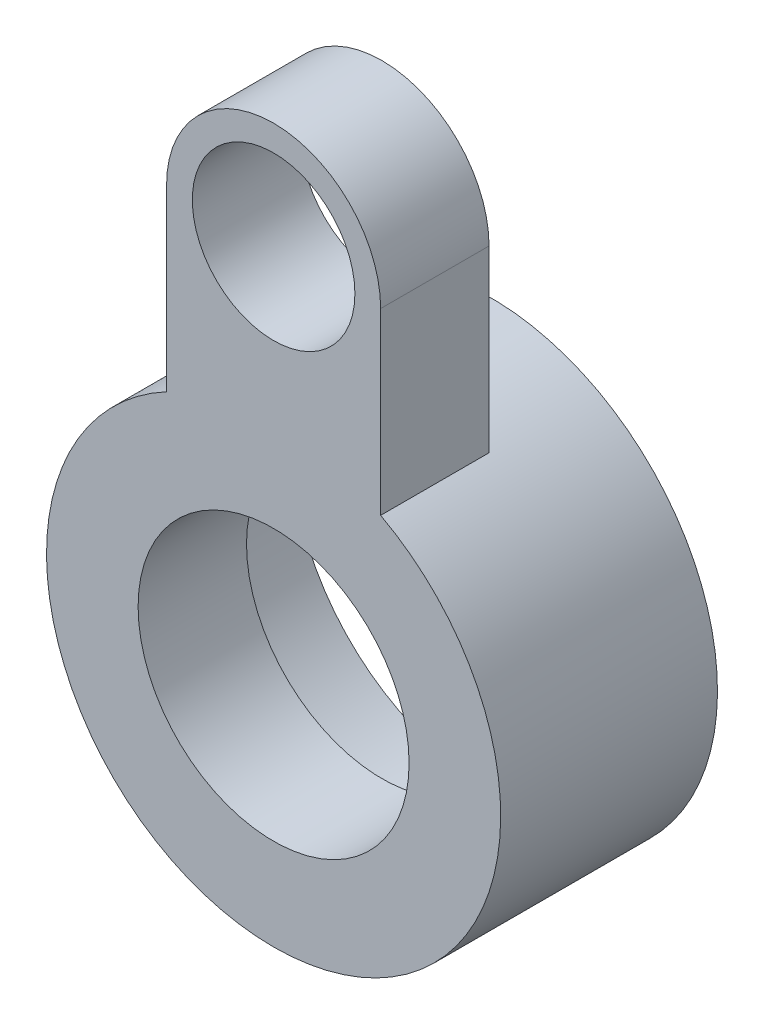
ISO-10303-21;
HEADER;
FILE_DESCRIPTION(('STEP AP214'),'2;1');
FILE_NAME('part.step','',(''),(''),'','','');
FILE_SCHEMA(('AUTOMOTIVE_DESIGN { 1 0 10303 214 1 1 1 1 }'));
ENDSEC;
DATA;
#1=APPLICATION_CONTEXT('core data for automotive mechanical design processes');
#2=APPLICATION_PROTOCOL_DEFINITION('international standard','automotive_design',2000,#1);
#3=PRODUCT_CONTEXT('',#1,'mechanical');
#4=PRODUCT('Part','Part','',(#3));
#5=PRODUCT_RELATED_PRODUCT_CATEGORY('part','',(#4));
#6=PRODUCT_DEFINITION_FORMATION('','',#4);
#7=PRODUCT_DEFINITION_CONTEXT('part definition',#1,'design');
#8=PRODUCT_DEFINITION('design','',#6,#7);
#9=PRODUCT_DEFINITION_SHAPE('','',#8);
#10=(LENGTH_UNIT() NAMED_UNIT(*) SI_UNIT(.MILLI.,.METRE.));
#11=(NAMED_UNIT(*) PLANE_ANGLE_UNIT() SI_UNIT($,.RADIAN.));
#12=(NAMED_UNIT(*) SI_UNIT($,.STERADIAN.) SOLID_ANGLE_UNIT());
#13=UNCERTAINTY_MEASURE_WITH_UNIT(LENGTH_MEASURE(1.E-05),#10,'distance_accuracy_value','');
#14=(GEOMETRIC_REPRESENTATION_CONTEXT(3) GLOBAL_UNCERTAINTY_ASSIGNED_CONTEXT((#13)) GLOBAL_UNIT_ASSIGNED_CONTEXT((#10,
#11,#12)) REPRESENTATION_CONTEXT('',''));
#15=CARTESIAN_POINT('',(0.,0.,0.));
#16=DIRECTION('',(0.,0.,1.));
#17=DIRECTION('',(1.,0.,0.));
#18=AXIS2_PLACEMENT_3D('',#15,#16,#17);
#19=CARTESIAN_POINT('',(0.,0.,0.));
#20=DIRECTION('',(0.,0.,1.));
#21=DIRECTION('',(1.,0.,0.));
#22=AXIS2_PLACEMENT_3D('',#19,#20,#21);
#23=PLANE('',#22);
#24=CARTESIAN_POINT('',(0.,0.,0.));
#25=DIRECTION('',(0.,0.,1.));
#26=DIRECTION('',(1.,0.,0.));
#27=AXIS2_PLACEMENT_3D('',#24,#25,#26);
#28=CIRCLE('',#27,2.5);
#29=CARTESIAN_POINT('',(2.5,0.,0.));
#30=VERTEX_POINT('',#29);
#31=EDGE_CURVE('E114',#30,#30,#28,.T.);
#32=ORIENTED_EDGE('',*,*,#31,.T.);
#33=EDGE_LOOP('',(#32));
#34=FACE_BOUND('',#33,.T.);
#35=CARTESIAN_POINT('',(0.,0.,0.));
#36=DIRECTION('',(0.,0.,-1.));
#37=DIRECTION('',(-1.,0.,0.));
#38=AXIS2_PLACEMENT_3D('',#35,#36,#37);
#39=CIRCLE('',#38,3.66714952792172);
#40=CARTESIAN_POINT('',(-3.66714952792172,0.,0.));
#41=VERTEX_POINT('',#40);
#42=EDGE_CURVE('E162',#41,#41,#39,.T.);
#43=ORIENTED_EDGE('',*,*,#42,.T.);
#44=EDGE_LOOP('',(#43));
#45=FACE_BOUND('',#44,.T.);
#46=ADVANCED_FACE('F52',(#34,#45),#23,.F.);
#47=CARTESIAN_POINT('',(0.,0.,2.));
#48=DIRECTION('',(0.,0.,1.));
#49=DIRECTION('',(1.,0.,0.));
#50=AXIS2_PLACEMENT_3D('',#47,#48,#49);
#51=PLANE('',#50);
#52=CARTESIAN_POINT('',(0.,0.,2.));
#53=DIRECTION('',(0.,0.,1.));
#54=DIRECTION('',(1.,0.,0.));
#55=AXIS2_PLACEMENT_3D('',#52,#53,#54);
#56=CIRCLE('',#55,2.5);
#57=CARTESIAN_POINT('',(2.5,0.,2.));
#58=VERTEX_POINT('',#57);
#59=EDGE_CURVE('E120',#58,#58,#56,.T.);
#60=ORIENTED_EDGE('',*,*,#59,.F.);
#61=EDGE_LOOP('',(#60));
#62=FACE_BOUND('',#61,.T.);
#63=CARTESIAN_POINT('',(0.,7.,2.));
#64=DIRECTION('',(0.,0.,1.));
#65=DIRECTION('',(1.,0.,0.));
#66=AXIS2_PLACEMENT_3D('',#63,#64,#65);
#67=CIRCLE('',#66,1.5);
#68=CARTESIAN_POINT('',(1.5,7.,2.));
#69=VERTEX_POINT('',#68);
#70=EDGE_CURVE('E136',#69,#69,#67,.T.);
#71=ORIENTED_EDGE('',*,*,#70,.F.);
#72=EDGE_LOOP('',(#71));
#73=FACE_BOUND('',#72,.T.);
#74=DIRECTION('',(0.,-1.,0.));
#75=VECTOR('',#74,1.);
#76=CARTESIAN_POINT('',(-1.975,7.,2.));
#77=LINE('',#76,#75);
#78=CARTESIAN_POINT('',(-1.975,7.,2.));
#79=VERTEX_POINT('',#78);
#80=CARTESIAN_POINT('',(-1.975,3.69533151422169,2.));
#81=VERTEX_POINT('',#80);
#82=EDGE_CURVE('E156',#79,#81,#77,.T.);
#83=ORIENTED_EDGE('',*,*,#82,.T.);
#84=CARTESIAN_POINT('',(0.,0.,2.));
#85=DIRECTION('',(0.,0.,1.));
#86=DIRECTION('',(1.,0.,0.));
#87=AXIS2_PLACEMENT_3D('',#84,#85,#86);
#88=CIRCLE('',#87,4.19);
#89=CARTESIAN_POINT('',(1.975,3.6953315142217,2.));
#90=VERTEX_POINT('',#89);
#91=EDGE_CURVE('E111',#81,#90,#88,.T.);
#92=ORIENTED_EDGE('',*,*,#91,.T.);
#93=DIRECTION('',(0.,1.,0.));
#94=VECTOR('',#93,1.);
#95=CARTESIAN_POINT('',(1.97499999999999,7.,2.));
#96=LINE('',#95,#94);
#97=CARTESIAN_POINT('',(1.97499999999999,7.,2.));
#98=VERTEX_POINT('',#97);
#99=EDGE_CURVE('E150',#90,#98,#96,.T.);
#100=ORIENTED_EDGE('',*,*,#99,.T.);
#101=CARTESIAN_POINT('',(0.,7.,2.));
#102=DIRECTION('',(0.,0.,1.));
#103=DIRECTION('',(1.,0.,0.));
#104=AXIS2_PLACEMENT_3D('',#101,#102,#103);
#105=CIRCLE('',#104,1.975);
#106=EDGE_CURVE('E68',#98,#79,#105,.T.);
#107=ORIENTED_EDGE('',*,*,#106,.T.);
#108=EDGE_LOOP('',(#83,#92,#100,#107));
#109=FACE_BOUND('',#108,.T.);
#110=ADVANCED_FACE('F152',(#62,#73,#109),#51,.T.);
#111=CARTESIAN_POINT('',(0.,0.,0.));
#112=DIRECTION('',(0.,0.,-1.));
#113=DIRECTION('',(-1.,0.,0.));
#114=AXIS2_PLACEMENT_3D('',#111,#112,#113);
#115=CIRCLE('',#114,4.19);
#116=CARTESIAN_POINT('',(-1.975,3.69533151422169,0.));
#117=VERTEX_POINT('',#116);
#118=CARTESIAN_POINT('',(1.975,3.6953315142217,0.));
#119=VERTEX_POINT('',#118);
#120=EDGE_CURVE('E76',#117,#119,#115,.T.);
#121=ORIENTED_EDGE('',*,*,#120,.F.);
#122=DIRECTION('',(0.,-1.,0.));
#123=VECTOR('',#122,1.);
#124=CARTESIAN_POINT('',(-1.975,0.,0.));
#125=LINE('',#124,#123);
#126=CARTESIAN_POINT('',(-1.975,7.,0.));
#127=VERTEX_POINT('',#126);
#128=EDGE_CURVE('E13',#127,#117,#125,.T.);
#129=ORIENTED_EDGE('',*,*,#128,.F.);
#130=CARTESIAN_POINT('',(0.,7.,0.));
#131=DIRECTION('',(0.,0.,1.));
#132=DIRECTION('',(1.,0.,0.));
#133=AXIS2_PLACEMENT_3D('',#130,#131,#132);
#134=CIRCLE('',#133,1.975);
#135=CARTESIAN_POINT('',(1.975,7.,0.));
#136=VERTEX_POINT('',#135);
#137=EDGE_CURVE('E61',#136,#127,#134,.T.);
#138=ORIENTED_EDGE('',*,*,#137,.F.);
#139=DIRECTION('',(0.,1.,0.));
#140=VECTOR('',#139,1.);
#141=CARTESIAN_POINT('',(1.975,0.,0.));
#142=LINE('',#141,#140);
#143=EDGE_CURVE('E97',#119,#136,#142,.T.);
#144=ORIENTED_EDGE('',*,*,#143,.F.);
#145=EDGE_LOOP('',(#121,#129,#138,#144));
#146=FACE_BOUND('',#145,.T.);
#147=CARTESIAN_POINT('',(0.,7.,0.));
#148=DIRECTION('',(0.,0.,1.));
#149=DIRECTION('',(1.,0.,0.));
#150=AXIS2_PLACEMENT_3D('',#147,#148,#149);
#151=CIRCLE('',#150,1.5);
#152=CARTESIAN_POINT('',(1.5,7.,0.));
#153=VERTEX_POINT('',#152);
#154=EDGE_CURVE('E134',#153,#153,#151,.T.);
#155=ORIENTED_EDGE('',*,*,#154,.T.);
#156=EDGE_LOOP('',(#155));
#157=FACE_BOUND('',#156,.T.);
#158=ADVANCED_FACE('F54',(#146,#157),#23,.F.);
#159=CARTESIAN_POINT('',(0.,7.,2.));
#160=DIRECTION('',(0.,0.,-1.));
#161=DIRECTION('',(-1.,0.,0.));
#162=AXIS2_PLACEMENT_3D('',#159,#160,#161);
#163=CYLINDRICAL_SURFACE('',#162,1.5);
#164=ORIENTED_EDGE('',*,*,#70,.T.);
#165=EDGE_LOOP('',(#164));
#166=FACE_BOUND('',#165,.T.);
#167=ORIENTED_EDGE('',*,*,#154,.F.);
#168=EDGE_LOOP('',(#167));
#169=FACE_BOUND('',#168,.T.);
#170=ADVANCED_FACE('F190',(#166,#169),#163,.F.);
#171=CARTESIAN_POINT('',(0.,0.,2.));
#172=DIRECTION('',(0.,0.,-1.));
#173=DIRECTION('',(-1.,0.,0.));
#174=AXIS2_PLACEMENT_3D('',#171,#172,#173);
#175=CYLINDRICAL_SURFACE('',#174,2.5);
#176=ORIENTED_EDGE('',*,*,#59,.T.);
#177=EDGE_LOOP('',(#176));
#178=FACE_BOUND('',#177,.T.);
#179=ORIENTED_EDGE('',*,*,#31,.F.);
#180=EDGE_LOOP('',(#179));
#181=FACE_BOUND('',#180,.T.);
#182=ADVANCED_FACE('F194',(#178,#181),#175,.F.);
#183=CARTESIAN_POINT('',(0.,0.,-8.));
#184=DIRECTION('',(0.,0.,1.));
#185=DIRECTION('',(1.,0.,0.));
#186=AXIS2_PLACEMENT_3D('',#183,#184,#185);
#187=CYLINDRICAL_SURFACE('',#186,4.19);
#188=DIRECTION('',(0.,0.,1.));
#189=VECTOR('',#188,1.);
#190=CARTESIAN_POINT('',(-1.975,3.69533151422169,-8.));
#191=LINE('',#190,#189);
#192=EDGE_CURVE('E105',#117,#81,#191,.T.);
#193=ORIENTED_EDGE('',*,*,#192,.F.);
#194=ORIENTED_EDGE('',*,*,#120,.T.);
#195=DIRECTION('',(0.,0.,1.));
#196=VECTOR('',#195,1.);
#197=CARTESIAN_POINT('',(1.975,3.6953315142217,-8.));
#198=LINE('',#197,#196);
#199=EDGE_CURVE('E130',#119,#90,#198,.T.);
#200=ORIENTED_EDGE('',*,*,#199,.T.);
#201=ORIENTED_EDGE('',*,*,#91,.F.);
#202=EDGE_LOOP('',(#193,#194,#200,#201));
#203=FACE_BOUND('',#202,.T.);
#204=CARTESIAN_POINT('',(0.,0.,-2.));
#205=DIRECTION('',(0.,0.,-1.));
#206=DIRECTION('',(-1.,0.,0.));
#207=AXIS2_PLACEMENT_3D('',#204,#205,#206);
#208=CIRCLE('',#207,4.19);
#209=CARTESIAN_POINT('',(-4.19,0.,-2.));
#210=VERTEX_POINT('',#209);
#211=EDGE_CURVE('E98',#210,#210,#208,.T.);
#212=ORIENTED_EDGE('',*,*,#211,.F.);
#213=EDGE_LOOP('',(#212));
#214=FACE_BOUND('',#213,.T.);
#215=ADVANCED_FACE('F108',(#203,#214),#187,.T.);
#216=CARTESIAN_POINT('',(-1.975,7.,-8.));
#217=DIRECTION('',(-1.,0.,0.));
#218=DIRECTION('',(0.,-1.,0.));
#219=AXIS2_PLACEMENT_3D('',#216,#217,#218);
#220=PLANE('',#219);
#221=ORIENTED_EDGE('',*,*,#128,.T.);
#222=ORIENTED_EDGE('',*,*,#192,.T.);
#223=ORIENTED_EDGE('',*,*,#82,.F.);
#224=DIRECTION('',(0.,0.,1.));
#225=VECTOR('',#224,1.);
#226=CARTESIAN_POINT('',(-1.975,7.,-8.));
#227=LINE('',#226,#225);
#228=EDGE_CURVE('E107',#127,#79,#227,.T.);
#229=ORIENTED_EDGE('',*,*,#228,.F.);
#230=EDGE_LOOP('',(#221,#222,#223,#229));
#231=FACE_BOUND('',#230,.T.);
#232=ADVANCED_FACE('F103',(#231),#220,.T.);
#233=CARTESIAN_POINT('',(0.,7.,-8.));
#234=DIRECTION('',(0.,0.,1.));
#235=DIRECTION('',(1.,0.,0.));
#236=AXIS2_PLACEMENT_3D('',#233,#234,#235);
#237=CYLINDRICAL_SURFACE('',#236,1.975);
#238=ORIENTED_EDGE('',*,*,#137,.T.);
#239=ORIENTED_EDGE('',*,*,#228,.T.);
#240=ORIENTED_EDGE('',*,*,#106,.F.);
#241=DIRECTION('',(0.,0.,1.));
#242=VECTOR('',#241,1.);
#243=CARTESIAN_POINT('',(1.975,7.,-8.));
#244=LINE('',#243,#242);
#245=EDGE_CURVE('E123',#136,#98,#244,.T.);
#246=ORIENTED_EDGE('',*,*,#245,.F.);
#247=EDGE_LOOP('',(#238,#239,#240,#246));
#248=FACE_BOUND('',#247,.T.);
#249=ADVANCED_FACE('F145',(#248),#237,.T.);
#250=CARTESIAN_POINT('',(1.97499999999999,7.,-8.));
#251=DIRECTION('',(1.,0.,0.));
#252=DIRECTION('',(0.,1.,0.));
#253=AXIS2_PLACEMENT_3D('',#250,#251,#252);
#254=PLANE('',#253);
#255=ORIENTED_EDGE('',*,*,#143,.T.);
#256=ORIENTED_EDGE('',*,*,#245,.T.);
#257=ORIENTED_EDGE('',*,*,#99,.F.);
#258=ORIENTED_EDGE('',*,*,#199,.F.);
#259=EDGE_LOOP('',(#255,#256,#257,#258));
#260=FACE_BOUND('',#259,.T.);
#261=ADVANCED_FACE('F149',(#260),#254,.T.);
#262=CARTESIAN_POINT('',(0.,0.,-2.));
#263=DIRECTION('',(0.,0.,-1.));
#264=DIRECTION('',(-1.,0.,0.));
#265=AXIS2_PLACEMENT_3D('',#262,#263,#264);
#266=PLANE('',#265);
#267=ORIENTED_EDGE('',*,*,#211,.T.);
#268=EDGE_LOOP('',(#267));
#269=FACE_BOUND('',#268,.T.);
#270=CARTESIAN_POINT('',(0.,0.,-2.));
#271=DIRECTION('',(0.,0.,-1.));
#272=DIRECTION('',(-1.,0.,0.));
#273=AXIS2_PLACEMENT_3D('',#270,#271,#272);
#274=CIRCLE('',#273,3.66714952792172);
#275=CARTESIAN_POINT('',(-3.66714952792172,0.,-2.));
#276=VERTEX_POINT('',#275);
#277=EDGE_CURVE('E99',#276,#276,#274,.T.);
#278=ORIENTED_EDGE('',*,*,#277,.F.);
#279=EDGE_LOOP('',(#278));
#280=FACE_BOUND('',#279,.T.);
#281=ADVANCED_FACE('F171',(#269,#280),#266,.T.);
#282=CARTESIAN_POINT('',(0.,0.,-2.));
#283=DIRECTION('',(0.,0.,1.));
#284=DIRECTION('',(1.,0.,0.));
#285=AXIS2_PLACEMENT_3D('',#282,#283,#284);
#286=CYLINDRICAL_SURFACE('',#285,3.66714952792172);
#287=ORIENTED_EDGE('',*,*,#277,.T.);
#288=EDGE_LOOP('',(#287));
#289=FACE_BOUND('',#288,.T.);
#290=ORIENTED_EDGE('',*,*,#42,.F.);
#291=EDGE_LOOP('',(#290));
#292=FACE_BOUND('',#291,.T.);
#293=ADVANCED_FACE('F168',(#289,#292),#286,.F.);
#294=CLOSED_SHELL('',(#46,#110,#158,#170,#182,#215,#232,#249,#261,#281,#293));
#295=MANIFOLD_SOLID_BREP('B2',#294);
#296=ADVANCED_BREP_SHAPE_REPRESENTATION('',(#18,#295),#14);
#297=SHAPE_DEFINITION_REPRESENTATION(#9,#296);
ENDSEC;
END-ISO-10303-21;
